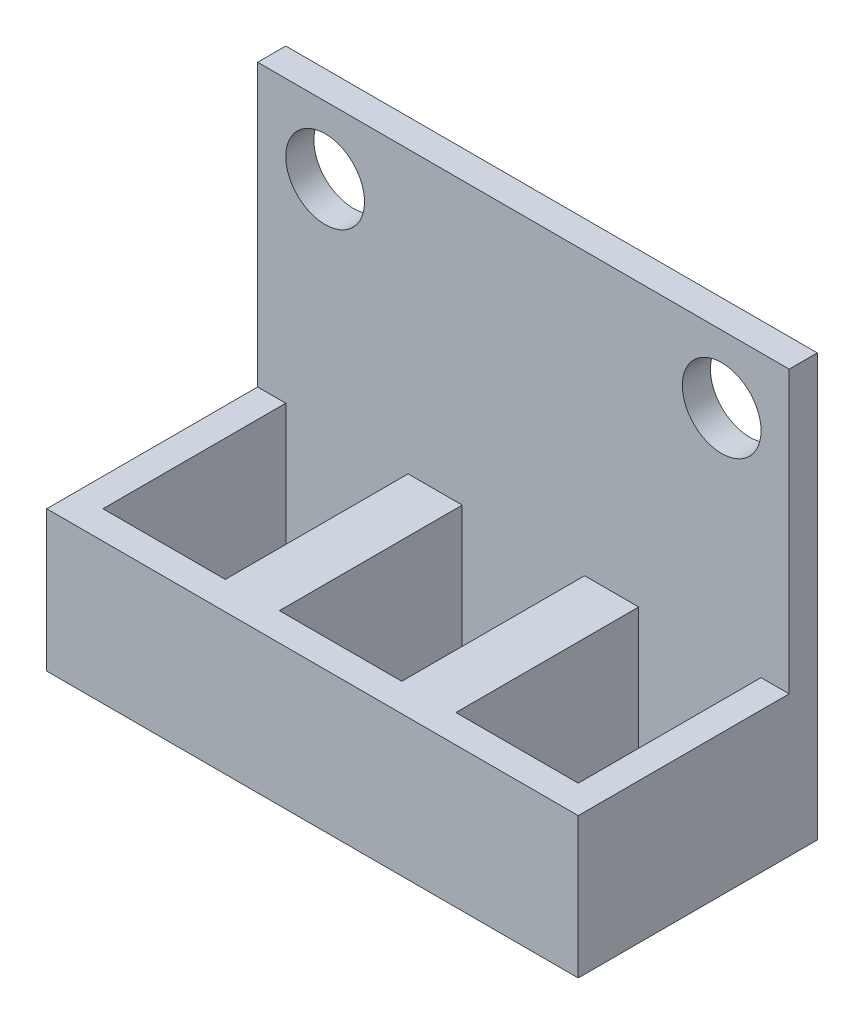
ISO-10303-21;
HEADER;
FILE_DESCRIPTION(('STEP AP214'),'2;1');
FILE_NAME('part.step','',(''),(''),'','','');
FILE_SCHEMA(('AUTOMOTIVE_DESIGN { 1 0 10303 214 1 1 1 1 }'));
ENDSEC;
DATA;
#1=APPLICATION_CONTEXT('core data for automotive mechanical design processes');
#2=APPLICATION_PROTOCOL_DEFINITION('international standard','automotive_design',2000,#1);
#3=PRODUCT_CONTEXT('',#1,'mechanical');
#4=PRODUCT('Part','Part','',(#3));
#5=PRODUCT_RELATED_PRODUCT_CATEGORY('part','',(#4));
#6=PRODUCT_DEFINITION_FORMATION('','',#4);
#7=PRODUCT_DEFINITION_CONTEXT('part definition',#1,'design');
#8=PRODUCT_DEFINITION('design','',#6,#7);
#9=PRODUCT_DEFINITION_SHAPE('','',#8);
#10=(LENGTH_UNIT() NAMED_UNIT(*) SI_UNIT(.MILLI.,.METRE.));
#11=(NAMED_UNIT(*) PLANE_ANGLE_UNIT() SI_UNIT($,.RADIAN.));
#12=(NAMED_UNIT(*) SI_UNIT($,.STERADIAN.) SOLID_ANGLE_UNIT());
#13=UNCERTAINTY_MEASURE_WITH_UNIT(LENGTH_MEASURE(1.E-05),#10,'distance_accuracy_value','');
#14=(GEOMETRIC_REPRESENTATION_CONTEXT(3) GLOBAL_UNCERTAINTY_ASSIGNED_CONTEXT((#13)) GLOBAL_UNIT_ASSIGNED_CONTEXT((#10,
#11,#12)) REPRESENTATION_CONTEXT('',''));
#15=CARTESIAN_POINT('',(0.,0.,0.));
#16=DIRECTION('',(0.,0.,1.));
#17=DIRECTION('',(1.,0.,0.));
#18=AXIS2_PLACEMENT_3D('',#15,#16,#17);
#19=CARTESIAN_POINT('',(0.,5.,0.));
#20=DIRECTION('',(0.,-1.,0.));
#21=DIRECTION('',(0.,0.,-1.));
#22=AXIS2_PLACEMENT_3D('',#19,#20,#21);
#23=PLANE('',#22);
#24=DIRECTION('',(1.,0.,0.));
#25=VECTOR('',#24,1.);
#26=CARTESIAN_POINT('',(-9.45,5.,-3.24999999999999));
#27=LINE('',#26,#25);
#28=CARTESIAN_POINT('',(-9.45,5.,-3.24999999999999));
#29=VERTEX_POINT('',#28);
#30=CARTESIAN_POINT('',(-8.45,5.,-3.25));
#31=VERTEX_POINT('',#30);
#32=EDGE_CURVE('E52',#29,#31,#27,.T.);
#33=ORIENTED_EDGE('',*,*,#32,.F.);
#34=DIRECTION('',(0.,0.,1.));
#35=VECTOR('',#34,1.);
#36=CARTESIAN_POINT('',(-9.45,5.,4.25000000000001));
#37=LINE('',#36,#35);
#38=CARTESIAN_POINT('',(-9.45,5.,4.25000000000001));
#39=VERTEX_POINT('',#38);
#40=EDGE_CURVE('E187',#29,#39,#37,.T.);
#41=ORIENTED_EDGE('',*,*,#40,.T.);
#42=DIRECTION('',(1.,0.,0.));
#43=VECTOR('',#42,1.);
#44=CARTESIAN_POINT('',(-9.45,5.,4.25000000000001));
#45=LINE('',#44,#43);
#46=CARTESIAN_POINT('',(9.45,5.,4.25000000000001));
#47=VERTEX_POINT('',#46);
#48=EDGE_CURVE('E298',#39,#47,#45,.T.);
#49=ORIENTED_EDGE('',*,*,#48,.T.);
#50=DIRECTION('',(0.,0.,-1.));
#51=VECTOR('',#50,1.);
#52=CARTESIAN_POINT('',(9.45,5.,4.25000000000001));
#53=LINE('',#52,#51);
#54=CARTESIAN_POINT('',(9.45,5.,-3.24999999999999));
#55=VERTEX_POINT('',#54);
#56=EDGE_CURVE('E293',#47,#55,#53,.T.);
#57=ORIENTED_EDGE('',*,*,#56,.T.);
#58=CARTESIAN_POINT('',(8.45,5.,-3.24999999999999));
#59=VERTEX_POINT('',#58);
#60=EDGE_CURVE('E235',#59,#55,#27,.T.);
#61=ORIENTED_EDGE('',*,*,#60,.F.);
#62=DIRECTION('',(0.,0.,-1.));
#63=VECTOR('',#62,1.);
#64=CARTESIAN_POINT('',(8.45,5.,-3.24999999999999));
#65=LINE('',#64,#63);
#66=CARTESIAN_POINT('',(8.45,5.,3.25));
#67=VERTEX_POINT('',#66);
#68=EDGE_CURVE('E258',#67,#59,#65,.T.);
#69=ORIENTED_EDGE('',*,*,#68,.F.);
#70=DIRECTION('',(1.,0.,0.));
#71=VECTOR('',#70,1.);
#72=CARTESIAN_POINT('',(4.1,5.,3.25));
#73=LINE('',#72,#71);
#74=CARTESIAN_POINT('',(4.1,5.,3.25));
#75=VERTEX_POINT('',#74);
#76=EDGE_CURVE('E257',#75,#67,#73,.T.);
#77=ORIENTED_EDGE('',*,*,#76,.F.);
#78=DIRECTION('',(0.,0.,1.));
#79=VECTOR('',#78,1.);
#80=CARTESIAN_POINT('',(4.1,5.,-3.24999999999999));
#81=LINE('',#80,#79);
#82=CARTESIAN_POINT('',(4.1,5.,-3.24999999999999));
#83=VERTEX_POINT('',#82);
#84=EDGE_CURVE('E255',#83,#75,#81,.T.);
#85=ORIENTED_EDGE('',*,*,#84,.F.);
#86=CARTESIAN_POINT('',(2.175,5.,-3.24999999999999));
#87=VERTEX_POINT('',#86);
#88=EDGE_CURVE('E44',#87,#83,#27,.T.);
#89=ORIENTED_EDGE('',*,*,#88,.F.);
#90=DIRECTION('',(0.,0.,-1.));
#91=VECTOR('',#90,1.);
#92=CARTESIAN_POINT('',(2.175,5.,-3.24999999999999));
#93=LINE('',#92,#91);
#94=CARTESIAN_POINT('',(2.175,5.,3.25));
#95=VERTEX_POINT('',#94);
#96=EDGE_CURVE('E223',#95,#87,#93,.T.);
#97=ORIENTED_EDGE('',*,*,#96,.F.);
#98=DIRECTION('',(1.,0.,0.));
#99=VECTOR('',#98,1.);
#100=CARTESIAN_POINT('',(-2.175,5.,3.25));
#101=LINE('',#100,#99);
#102=CARTESIAN_POINT('',(-2.175,5.,3.25));
#103=VERTEX_POINT('',#102);
#104=EDGE_CURVE('E222',#103,#95,#101,.T.);
#105=ORIENTED_EDGE('',*,*,#104,.F.);
#106=DIRECTION('',(0.,0.,1.));
#107=VECTOR('',#106,1.);
#108=CARTESIAN_POINT('',(-2.175,5.,-3.24999999999999));
#109=LINE('',#108,#107);
#110=CARTESIAN_POINT('',(-2.175,5.,-3.24999999999999));
#111=VERTEX_POINT('',#110);
#112=EDGE_CURVE('E219',#111,#103,#109,.T.);
#113=ORIENTED_EDGE('',*,*,#112,.F.);
#114=CARTESIAN_POINT('',(-4.1,5.,-3.25));
#115=VERTEX_POINT('',#114);
#116=EDGE_CURVE('E11',#115,#111,#27,.T.);
#117=ORIENTED_EDGE('',*,*,#116,.F.);
#118=DIRECTION('',(0.,0.,-1.));
#119=VECTOR('',#118,1.);
#120=CARTESIAN_POINT('',(-4.1,5.,-3.25));
#121=LINE('',#120,#119);
#122=CARTESIAN_POINT('',(-4.1,5.,3.25));
#123=VERTEX_POINT('',#122);
#124=EDGE_CURVE('E200',#123,#115,#121,.T.);
#125=ORIENTED_EDGE('',*,*,#124,.F.);
#126=DIRECTION('',(1.,0.,0.));
#127=VECTOR('',#126,1.);
#128=CARTESIAN_POINT('',(-8.45,5.,3.25));
#129=LINE('',#128,#127);
#130=CARTESIAN_POINT('',(-8.45,5.,3.25));
#131=VERTEX_POINT('',#130);
#132=EDGE_CURVE('E199',#131,#123,#129,.T.);
#133=ORIENTED_EDGE('',*,*,#132,.F.);
#134=DIRECTION('',(0.,0.,1.));
#135=VECTOR('',#134,1.);
#136=CARTESIAN_POINT('',(-8.45,5.,-3.25));
#137=LINE('',#136,#135);
#138=EDGE_CURVE('E196',#31,#131,#137,.T.);
#139=ORIENTED_EDGE('',*,*,#138,.F.);
#140=EDGE_LOOP('',(#33,#41,#49,#57,#61,#69,#77,#85,#89,#97,#105,#113,#117,#125,#133,#139));
#141=FACE_BOUND('',#140,.T.);
#142=ADVANCED_FACE('F35',(#141),#23,.F.);
#143=CARTESIAN_POINT('',(0.,0.,0.));
#144=DIRECTION('',(0.,-1.,0.));
#145=DIRECTION('',(0.,0.,-1.));
#146=AXIS2_PLACEMENT_3D('',#143,#144,#145);
#147=PLANE('',#146);
#148=DIRECTION('',(1.,0.,0.));
#149=VECTOR('',#148,1.);
#150=CARTESIAN_POINT('',(-2.175,0.,3.25));
#151=LINE('',#150,#149);
#152=CARTESIAN_POINT('',(-2.175,0.,3.25));
#153=VERTEX_POINT('',#152);
#154=CARTESIAN_POINT('',(2.175,0.,3.25));
#155=VERTEX_POINT('',#154);
#156=EDGE_CURVE('E263',#153,#155,#151,.T.);
#157=ORIENTED_EDGE('',*,*,#156,.T.);
#158=DIRECTION('',(0.,0.,-1.));
#159=VECTOR('',#158,1.);
#160=CARTESIAN_POINT('',(2.175,0.,-3.24999999999999));
#161=LINE('',#160,#159);
#162=CARTESIAN_POINT('',(2.175,0.,-3.24999999999999));
#163=VERTEX_POINT('',#162);
#164=EDGE_CURVE('E558',#155,#163,#161,.T.);
#165=ORIENTED_EDGE('',*,*,#164,.T.);
#166=DIRECTION('',(-1.,0.,0.));
#167=VECTOR('',#166,1.);
#168=CARTESIAN_POINT('',(-2.175,0.,-3.24999999999999));
#169=LINE('',#168,#167);
#170=CARTESIAN_POINT('',(-2.175,0.,-3.24999999999999));
#171=VERTEX_POINT('',#170);
#172=EDGE_CURVE('E560',#163,#171,#169,.T.);
#173=ORIENTED_EDGE('',*,*,#172,.T.);
#174=DIRECTION('',(0.,0.,1.));
#175=VECTOR('',#174,1.);
#176=CARTESIAN_POINT('',(-2.175,0.,-3.24999999999999));
#177=LINE('',#176,#175);
#178=EDGE_CURVE('E563',#171,#153,#177,.T.);
#179=ORIENTED_EDGE('',*,*,#178,.T.);
#180=EDGE_LOOP('',(#157,#165,#173,#179));
#181=FACE_BOUND('',#180,.T.);
#182=DIRECTION('',(0.,0.,-1.));
#183=VECTOR('',#182,1.);
#184=CARTESIAN_POINT('',(9.45,0.,4.25000000000001));
#185=LINE('',#184,#183);
#186=CARTESIAN_POINT('',(9.45,0.,4.25000000000001));
#187=VERTEX_POINT('',#186);
#188=CARTESIAN_POINT('',(9.45,0.,-4.25));
#189=VERTEX_POINT('',#188);
#190=EDGE_CURVE('E211',#187,#189,#185,.T.);
#191=ORIENTED_EDGE('',*,*,#190,.F.);
#192=DIRECTION('',(1.,0.,0.));
#193=VECTOR('',#192,1.);
#194=CARTESIAN_POINT('',(-9.45,0.,4.25000000000001));
#195=LINE('',#194,#193);
#196=CARTESIAN_POINT('',(-9.45,0.,4.25000000000001));
#197=VERTEX_POINT('',#196);
#198=EDGE_CURVE('E295',#197,#187,#195,.T.);
#199=ORIENTED_EDGE('',*,*,#198,.F.);
#200=DIRECTION('',(0.,0.,1.));
#201=VECTOR('',#200,1.);
#202=CARTESIAN_POINT('',(-9.45,0.,4.25000000000001));
#203=LINE('',#202,#201);
#204=CARTESIAN_POINT('',(-9.45,0.,-4.25));
#205=VERTEX_POINT('',#204);
#206=EDGE_CURVE('E310',#205,#197,#203,.T.);
#207=ORIENTED_EDGE('',*,*,#206,.F.);
#208=DIRECTION('',(-1.,0.,0.));
#209=VECTOR('',#208,1.);
#210=CARTESIAN_POINT('',(-9.45,0.,-4.25));
#211=LINE('',#210,#209);
#212=EDGE_CURVE('E308',#189,#205,#211,.T.);
#213=ORIENTED_EDGE('',*,*,#212,.F.);
#214=EDGE_LOOP('',(#191,#199,#207,#213));
#215=FACE_BOUND('',#214,.T.);
#216=DIRECTION('',(1.,0.,0.));
#217=VECTOR('',#216,1.);
#218=CARTESIAN_POINT('',(-8.45,0.,3.25));
#219=LINE('',#218,#217);
#220=CARTESIAN_POINT('',(-8.45,0.,3.25));
#221=VERTEX_POINT('',#220);
#222=CARTESIAN_POINT('',(-4.1,0.,3.25));
#223=VERTEX_POINT('',#222);
#224=EDGE_CURVE('E216',#221,#223,#219,.T.);
#225=ORIENTED_EDGE('',*,*,#224,.T.);
#226=DIRECTION('',(0.,0.,-1.));
#227=VECTOR('',#226,1.);
#228=CARTESIAN_POINT('',(-4.1,0.,-3.25));
#229=LINE('',#228,#227);
#230=CARTESIAN_POINT('',(-4.1,0.,-3.25));
#231=VERTEX_POINT('',#230);
#232=EDGE_CURVE('E266',#223,#231,#229,.T.);
#233=ORIENTED_EDGE('',*,*,#232,.T.);
#234=DIRECTION('',(-1.,0.,0.));
#235=VECTOR('',#234,1.);
#236=CARTESIAN_POINT('',(-8.45,0.,-3.25));
#237=LINE('',#236,#235);
#238=CARTESIAN_POINT('',(-8.45,0.,-3.25));
#239=VERTEX_POINT('',#238);
#240=EDGE_CURVE('E271',#231,#239,#237,.T.);
#241=ORIENTED_EDGE('',*,*,#240,.T.);
#242=DIRECTION('',(0.,0.,1.));
#243=VECTOR('',#242,1.);
#244=CARTESIAN_POINT('',(-8.45,0.,-3.25));
#245=LINE('',#244,#243);
#246=EDGE_CURVE('E276',#239,#221,#245,.T.);
#247=ORIENTED_EDGE('',*,*,#246,.T.);
#248=EDGE_LOOP('',(#225,#233,#241,#247));
#249=FACE_BOUND('',#248,.T.);
#250=DIRECTION('',(1.,0.,0.));
#251=VECTOR('',#250,1.);
#252=CARTESIAN_POINT('',(4.1,0.,3.25));
#253=LINE('',#252,#251);
#254=CARTESIAN_POINT('',(4.1,0.,3.25));
#255=VERTEX_POINT('',#254);
#256=CARTESIAN_POINT('',(8.45,0.,3.25));
#257=VERTEX_POINT('',#256);
#258=EDGE_CURVE('E547',#255,#257,#253,.T.);
#259=ORIENTED_EDGE('',*,*,#258,.T.);
#260=DIRECTION('',(0.,0.,-1.));
#261=VECTOR('',#260,1.);
#262=CARTESIAN_POINT('',(8.45,0.,-3.24999999999999));
#263=LINE('',#262,#261);
#264=CARTESIAN_POINT('',(8.45,0.,-3.24999999999999));
#265=VERTEX_POINT('',#264);
#266=EDGE_CURVE('E188',#257,#265,#263,.T.);
#267=ORIENTED_EDGE('',*,*,#266,.T.);
#268=DIRECTION('',(-1.,0.,0.));
#269=VECTOR('',#268,1.);
#270=CARTESIAN_POINT('',(4.1,0.,-3.24999999999999));
#271=LINE('',#270,#269);
#272=CARTESIAN_POINT('',(4.1,0.,-3.24999999999999));
#273=VERTEX_POINT('',#272);
#274=EDGE_CURVE('E190',#265,#273,#271,.T.);
#275=ORIENTED_EDGE('',*,*,#274,.T.);
#276=DIRECTION('',(0.,0.,1.));
#277=VECTOR('',#276,1.);
#278=CARTESIAN_POINT('',(4.1,0.,-3.24999999999999));
#279=LINE('',#278,#277);
#280=EDGE_CURVE('E542',#273,#255,#279,.T.);
#281=ORIENTED_EDGE('',*,*,#280,.T.);
#282=EDGE_LOOP('',(#259,#267,#275,#281));
#283=FACE_BOUND('',#282,.T.);
#284=ADVANCED_FACE('F366',(#181,#215,#249,#283),#147,.T.);
#285=CARTESIAN_POINT('',(9.45,5.,4.25000000000001));
#286=DIRECTION('',(-1.,0.,0.));
#287=DIRECTION('',(0.,0.,1.));
#288=AXIS2_PLACEMENT_3D('',#285,#286,#287);
#289=PLANE('',#288);
#290=ORIENTED_EDGE('',*,*,#190,.T.);
#291=DIRECTION('',(0.,-1.,0.));
#292=VECTOR('',#291,1.);
#293=CARTESIAN_POINT('',(9.45,5.,-4.25));
#294=LINE('',#293,#292);
#295=CARTESIAN_POINT('',(9.45,15.,-4.25));
#296=VERTEX_POINT('',#295);
#297=EDGE_CURVE('E296',#296,#189,#294,.T.);
#298=ORIENTED_EDGE('',*,*,#297,.F.);
#299=DIRECTION('',(0.,0.,-1.));
#300=VECTOR('',#299,1.);
#301=CARTESIAN_POINT('',(9.45,15.,-4.25));
#302=LINE('',#301,#300);
#303=CARTESIAN_POINT('',(9.45,15.,-3.24999999999999));
#304=VERTEX_POINT('',#303);
#305=EDGE_CURVE('E174',#304,#296,#302,.T.);
#306=ORIENTED_EDGE('',*,*,#305,.F.);
#307=DIRECTION('',(0.,-1.,0.));
#308=VECTOR('',#307,1.);
#309=CARTESIAN_POINT('',(9.45,15.,-3.24999999999999));
#310=LINE('',#309,#308);
#311=EDGE_CURVE('E170',#304,#55,#310,.T.);
#312=ORIENTED_EDGE('',*,*,#311,.T.);
#313=ORIENTED_EDGE('',*,*,#56,.F.);
#314=DIRECTION('',(0.,-1.,0.));
#315=VECTOR('',#314,1.);
#316=CARTESIAN_POINT('',(9.45,5.,4.25000000000001));
#317=LINE('',#316,#315);
#318=EDGE_CURVE('E299',#47,#187,#317,.T.);
#319=ORIENTED_EDGE('',*,*,#318,.T.);
#320=EDGE_LOOP('',(#290,#298,#306,#312,#313,#319));
#321=FACE_BOUND('',#320,.T.);
#322=ADVANCED_FACE('F37',(#321),#289,.F.);
#323=CARTESIAN_POINT('',(-9.45,5.,-4.25));
#324=DIRECTION('',(0.,0.,1.));
#325=DIRECTION('',(1.,0.,0.));
#326=AXIS2_PLACEMENT_3D('',#323,#324,#325);
#327=PLANE('',#326);
#328=CARTESIAN_POINT('',(-7.05,12.6,-4.25));
#329=DIRECTION('',(0.,0.,1.));
#330=DIRECTION('',(1.,0.,0.));
#331=AXIS2_PLACEMENT_3D('',#328,#329,#330);
#332=CIRCLE('',#331,1.4);
#333=CARTESIAN_POINT('',(-5.65,12.6,-4.25));
#334=VERTEX_POINT('',#333);
#335=EDGE_CURVE('E330',#334,#334,#332,.T.);
#336=ORIENTED_EDGE('',*,*,#335,.T.);
#337=EDGE_LOOP('',(#336));
#338=FACE_BOUND('',#337,.T.);
#339=CARTESIAN_POINT('',(7.05,12.6,-4.25));
#340=DIRECTION('',(0.,0.,1.));
#341=DIRECTION('',(1.,0.,0.));
#342=AXIS2_PLACEMENT_3D('',#339,#340,#341);
#343=CIRCLE('',#342,1.4);
#344=CARTESIAN_POINT('',(8.45,12.6,-4.25));
#345=VERTEX_POINT('',#344);
#346=EDGE_CURVE('E329',#345,#345,#343,.T.);
#347=ORIENTED_EDGE('',*,*,#346,.T.);
#348=EDGE_LOOP('',(#347));
#349=FACE_BOUND('',#348,.T.);
#350=ORIENTED_EDGE('',*,*,#212,.T.);
#351=DIRECTION('',(0.,-1.,0.));
#352=VECTOR('',#351,1.);
#353=CARTESIAN_POINT('',(-9.45,5.,-4.25));
#354=LINE('',#353,#352);
#355=CARTESIAN_POINT('',(-9.45,15.,-4.25));
#356=VERTEX_POINT('',#355);
#357=EDGE_CURVE('E314',#356,#205,#354,.T.);
#358=ORIENTED_EDGE('',*,*,#357,.F.);
#359=DIRECTION('',(-1.,0.,0.));
#360=VECTOR('',#359,1.);
#361=CARTESIAN_POINT('',(-9.45,15.,-4.25));
#362=LINE('',#361,#360);
#363=EDGE_CURVE('E181',#296,#356,#362,.T.);
#364=ORIENTED_EDGE('',*,*,#363,.F.);
#365=ORIENTED_EDGE('',*,*,#297,.T.);
#366=EDGE_LOOP('',(#350,#358,#364,#365));
#367=FACE_BOUND('',#366,.T.);
#368=ADVANCED_FACE('F339',(#338,#349,#367),#327,.F.);
#369=CARTESIAN_POINT('',(-9.45,5.,4.25000000000001));
#370=DIRECTION('',(1.,0.,0.));
#371=DIRECTION('',(0.,0.,-1.));
#372=AXIS2_PLACEMENT_3D('',#369,#370,#371);
#373=PLANE('',#372);
#374=ORIENTED_EDGE('',*,*,#206,.T.);
#375=DIRECTION('',(0.,-1.,0.));
#376=VECTOR('',#375,1.);
#377=CARTESIAN_POINT('',(-9.45,5.,4.25000000000001));
#378=LINE('',#377,#376);
#379=EDGE_CURVE('E303',#39,#197,#378,.T.);
#380=ORIENTED_EDGE('',*,*,#379,.F.);
#381=ORIENTED_EDGE('',*,*,#40,.F.);
#382=DIRECTION('',(0.,-1.,0.));
#383=VECTOR('',#382,1.);
#384=CARTESIAN_POINT('',(-9.45,15.,-3.24999999999999));
#385=LINE('',#384,#383);
#386=CARTESIAN_POINT('',(-9.45,15.,-3.24999999999999));
#387=VERTEX_POINT('',#386);
#388=EDGE_CURVE('E167',#387,#29,#385,.T.);
#389=ORIENTED_EDGE('',*,*,#388,.F.);
#390=DIRECTION('',(0.,0.,1.));
#391=VECTOR('',#390,1.);
#392=CARTESIAN_POINT('',(-9.45,15.,-4.25));
#393=LINE('',#392,#391);
#394=EDGE_CURVE('E175',#356,#387,#393,.T.);
#395=ORIENTED_EDGE('',*,*,#394,.F.);
#396=ORIENTED_EDGE('',*,*,#357,.T.);
#397=EDGE_LOOP('',(#374,#380,#381,#389,#395,#396));
#398=FACE_BOUND('',#397,.T.);
#399=ADVANCED_FACE('F185',(#398),#373,.F.);
#400=CARTESIAN_POINT('',(-9.45,5.,4.25000000000001));
#401=DIRECTION('',(0.,0.,-1.));
#402=DIRECTION('',(-1.,0.,0.));
#403=AXIS2_PLACEMENT_3D('',#400,#401,#402);
#404=PLANE('',#403);
#405=ORIENTED_EDGE('',*,*,#198,.T.);
#406=ORIENTED_EDGE('',*,*,#318,.F.);
#407=ORIENTED_EDGE('',*,*,#48,.F.);
#408=ORIENTED_EDGE('',*,*,#379,.T.);
#409=EDGE_LOOP('',(#405,#406,#407,#408));
#410=FACE_BOUND('',#409,.T.);
#411=ADVANCED_FACE('F375',(#410),#404,.F.);
#412=CARTESIAN_POINT('',(-4.1,5.,-3.25));
#413=DIRECTION('',(-1.,0.,0.));
#414=DIRECTION('',(0.,0.,1.));
#415=AXIS2_PLACEMENT_3D('',#412,#413,#414);
#416=PLANE('',#415);
#417=ORIENTED_EDGE('',*,*,#232,.F.);
#418=DIRECTION('',(0.,-1.,0.));
#419=VECTOR('',#418,1.);
#420=CARTESIAN_POINT('',(-4.1,5.,3.25));
#421=LINE('',#420,#419);
#422=EDGE_CURVE('E284',#123,#223,#421,.T.);
#423=ORIENTED_EDGE('',*,*,#422,.F.);
#424=ORIENTED_EDGE('',*,*,#124,.T.);
#425=DIRECTION('',(0.,-1.,0.));
#426=VECTOR('',#425,1.);
#427=CARTESIAN_POINT('',(-4.1,5.,-3.25));
#428=LINE('',#427,#426);
#429=EDGE_CURVE('E205',#115,#231,#428,.T.);
#430=ORIENTED_EDGE('',*,*,#429,.T.);
#431=EDGE_LOOP('',(#417,#423,#424,#430));
#432=FACE_BOUND('',#431,.T.);
#433=ADVANCED_FACE('F352',(#432),#416,.T.);
#434=CARTESIAN_POINT('',(-8.45,5.,-3.25));
#435=DIRECTION('',(0.,0.,1.));
#436=DIRECTION('',(1.,0.,0.));
#437=AXIS2_PLACEMENT_3D('',#434,#435,#436);
#438=PLANE('',#437);
#439=CARTESIAN_POINT('',(-7.05,12.6,-3.25));
#440=DIRECTION('',(0.,0.,1.));
#441=DIRECTION('',(1.,0.,0.));
#442=AXIS2_PLACEMENT_3D('',#439,#440,#441);
#443=CIRCLE('',#442,1.4);
#444=CARTESIAN_POINT('',(-5.65,12.6,-3.25));
#445=VERTEX_POINT('',#444);
#446=EDGE_CURVE('E333',#445,#445,#443,.T.);
#447=ORIENTED_EDGE('',*,*,#446,.F.);
#448=EDGE_LOOP('',(#447));
#449=FACE_BOUND('',#448,.T.);
#450=CARTESIAN_POINT('',(7.05,12.6,-3.25));
#451=DIRECTION('',(0.,0.,1.));
#452=DIRECTION('',(1.,0.,0.));
#453=AXIS2_PLACEMENT_3D('',#450,#451,#452);
#454=CIRCLE('',#453,1.4);
#455=CARTESIAN_POINT('',(8.45,12.6,-3.25));
#456=VERTEX_POINT('',#455);
#457=EDGE_CURVE('E326',#456,#456,#454,.T.);
#458=ORIENTED_EDGE('',*,*,#457,.F.);
#459=EDGE_LOOP('',(#458));
#460=FACE_BOUND('',#459,.T.);
#461=ORIENTED_EDGE('',*,*,#240,.F.);
#462=ORIENTED_EDGE('',*,*,#429,.F.);
#463=ORIENTED_EDGE('',*,*,#116,.T.);
#464=DIRECTION('',(0.,-1.,0.));
#465=VECTOR('',#464,1.);
#466=CARTESIAN_POINT('',(-2.175,5.,-3.24999999999999));
#467=LINE('',#466,#465);
#468=EDGE_CURVE('E226',#111,#171,#467,.T.);
#469=ORIENTED_EDGE('',*,*,#468,.T.);
#470=ORIENTED_EDGE('',*,*,#172,.F.);
#471=DIRECTION('',(0.,-1.,0.));
#472=VECTOR('',#471,1.);
#473=CARTESIAN_POINT('',(2.175,5.,-3.24999999999999));
#474=LINE('',#473,#472);
#475=EDGE_CURVE('E227',#87,#163,#474,.T.);
#476=ORIENTED_EDGE('',*,*,#475,.F.);
#477=ORIENTED_EDGE('',*,*,#88,.T.);
#478=DIRECTION('',(0.,-1.,0.));
#479=VECTOR('',#478,1.);
#480=CARTESIAN_POINT('',(4.1,5.,-3.24999999999999));
#481=LINE('',#480,#479);
#482=EDGE_CURVE('E250',#83,#273,#481,.T.);
#483=ORIENTED_EDGE('',*,*,#482,.T.);
#484=ORIENTED_EDGE('',*,*,#274,.F.);
#485=DIRECTION('',(0.,-1.,0.));
#486=VECTOR('',#485,1.);
#487=CARTESIAN_POINT('',(8.45,5.,-3.24999999999999));
#488=LINE('',#487,#486);
#489=EDGE_CURVE('E252',#59,#265,#488,.T.);
#490=ORIENTED_EDGE('',*,*,#489,.F.);
#491=ORIENTED_EDGE('',*,*,#60,.T.);
#492=ORIENTED_EDGE('',*,*,#311,.F.);
#493=DIRECTION('',(1.,0.,0.));
#494=VECTOR('',#493,1.);
#495=CARTESIAN_POINT('',(-9.45,15.,-3.24999999999999));
#496=LINE('',#495,#494);
#497=EDGE_CURVE('E163',#387,#304,#496,.T.);
#498=ORIENTED_EDGE('',*,*,#497,.F.);
#499=ORIENTED_EDGE('',*,*,#388,.T.);
#500=ORIENTED_EDGE('',*,*,#32,.T.);
#501=DIRECTION('',(0.,-1.,0.));
#502=VECTOR('',#501,1.);
#503=CARTESIAN_POINT('',(-8.45,5.,-3.25));
#504=LINE('',#503,#502);
#505=EDGE_CURVE('E203',#31,#239,#504,.T.);
#506=ORIENTED_EDGE('',*,*,#505,.T.);
#507=EDGE_LOOP('',(#461,#462,#463,#469,#470,#476,#477,#483,#484,#490,#491,#492,#498,#499,#500,#506));
#508=FACE_BOUND('',#507,.T.);
#509=ADVANCED_FACE('F165',(#449,#460,#508),#438,.T.);
#510=CARTESIAN_POINT('',(-8.45,5.,-3.25));
#511=DIRECTION('',(1.,0.,0.));
#512=DIRECTION('',(0.,0.,-1.));
#513=AXIS2_PLACEMENT_3D('',#510,#511,#512);
#514=PLANE('',#513);
#515=ORIENTED_EDGE('',*,*,#246,.F.);
#516=ORIENTED_EDGE('',*,*,#505,.F.);
#517=ORIENTED_EDGE('',*,*,#138,.T.);
#518=DIRECTION('',(0.,-1.,0.));
#519=VECTOR('',#518,1.);
#520=CARTESIAN_POINT('',(-8.45,5.,3.25));
#521=LINE('',#520,#519);
#522=EDGE_CURVE('E206',#131,#221,#521,.T.);
#523=ORIENTED_EDGE('',*,*,#522,.T.);
#524=EDGE_LOOP('',(#515,#516,#517,#523));
#525=FACE_BOUND('',#524,.T.);
#526=ADVANCED_FACE('F351',(#525),#514,.T.);
#527=CARTESIAN_POINT('',(-8.45,5.,3.25));
#528=DIRECTION('',(0.,0.,-1.));
#529=DIRECTION('',(-1.,0.,0.));
#530=AXIS2_PLACEMENT_3D('',#527,#528,#529);
#531=PLANE('',#530);
#532=ORIENTED_EDGE('',*,*,#224,.F.);
#533=ORIENTED_EDGE('',*,*,#522,.F.);
#534=ORIENTED_EDGE('',*,*,#132,.T.);
#535=ORIENTED_EDGE('',*,*,#422,.T.);
#536=EDGE_LOOP('',(#532,#533,#534,#535));
#537=FACE_BOUND('',#536,.T.);
#538=ADVANCED_FACE('F406',(#537),#531,.T.);
#539=CARTESIAN_POINT('',(2.175,5.,-3.24999999999999));
#540=DIRECTION('',(-1.,0.,0.));
#541=DIRECTION('',(0.,0.,1.));
#542=AXIS2_PLACEMENT_3D('',#539,#540,#541);
#543=PLANE('',#542);
#544=ORIENTED_EDGE('',*,*,#164,.F.);
#545=DIRECTION('',(0.,-1.,0.));
#546=VECTOR('',#545,1.);
#547=CARTESIAN_POINT('',(2.175,5.,3.25));
#548=LINE('',#547,#546);
#549=EDGE_CURVE('E557',#95,#155,#548,.T.);
#550=ORIENTED_EDGE('',*,*,#549,.F.);
#551=ORIENTED_EDGE('',*,*,#96,.T.);
#552=ORIENTED_EDGE('',*,*,#475,.T.);
#553=EDGE_LOOP('',(#544,#550,#551,#552));
#554=FACE_BOUND('',#553,.T.);
#555=ADVANCED_FACE('F411',(#554),#543,.T.);
#556=CARTESIAN_POINT('',(-2.175,5.,-3.24999999999999));
#557=DIRECTION('',(1.,0.,0.));
#558=DIRECTION('',(0.,0.,-1.));
#559=AXIS2_PLACEMENT_3D('',#556,#557,#558);
#560=PLANE('',#559);
#561=ORIENTED_EDGE('',*,*,#178,.F.);
#562=ORIENTED_EDGE('',*,*,#468,.F.);
#563=ORIENTED_EDGE('',*,*,#112,.T.);
#564=DIRECTION('',(0.,-1.,0.));
#565=VECTOR('',#564,1.);
#566=CARTESIAN_POINT('',(-2.175,5.,3.25));
#567=LINE('',#566,#565);
#568=EDGE_CURVE('E228',#103,#153,#567,.T.);
#569=ORIENTED_EDGE('',*,*,#568,.T.);
#570=EDGE_LOOP('',(#561,#562,#563,#569));
#571=FACE_BOUND('',#570,.T.);
#572=ADVANCED_FACE('F427',(#571),#560,.T.);
#573=CARTESIAN_POINT('',(-2.175,5.,3.25));
#574=DIRECTION('',(0.,0.,-1.));
#575=DIRECTION('',(-1.,0.,0.));
#576=AXIS2_PLACEMENT_3D('',#573,#574,#575);
#577=PLANE('',#576);
#578=ORIENTED_EDGE('',*,*,#156,.F.);
#579=ORIENTED_EDGE('',*,*,#568,.F.);
#580=ORIENTED_EDGE('',*,*,#104,.T.);
#581=ORIENTED_EDGE('',*,*,#549,.T.);
#582=EDGE_LOOP('',(#578,#579,#580,#581));
#583=FACE_BOUND('',#582,.T.);
#584=ADVANCED_FACE('F421',(#583),#577,.T.);
#585=CARTESIAN_POINT('',(8.45,5.,-3.24999999999999));
#586=DIRECTION('',(-1.,0.,0.));
#587=DIRECTION('',(0.,0.,1.));
#588=AXIS2_PLACEMENT_3D('',#585,#586,#587);
#589=PLANE('',#588);
#590=ORIENTED_EDGE('',*,*,#266,.F.);
#591=DIRECTION('',(0.,-1.,0.));
#592=VECTOR('',#591,1.);
#593=CARTESIAN_POINT('',(8.45,5.,3.25));
#594=LINE('',#593,#592);
#595=EDGE_CURVE('E552',#67,#257,#594,.T.);
#596=ORIENTED_EDGE('',*,*,#595,.F.);
#597=ORIENTED_EDGE('',*,*,#68,.T.);
#598=ORIENTED_EDGE('',*,*,#489,.T.);
#599=EDGE_LOOP('',(#590,#596,#597,#598));
#600=FACE_BOUND('',#599,.T.);
#601=ADVANCED_FACE('F426',(#600),#589,.T.);
#602=CARTESIAN_POINT('',(4.1,5.,-3.24999999999999));
#603=DIRECTION('',(1.,0.,0.));
#604=DIRECTION('',(0.,0.,-1.));
#605=AXIS2_PLACEMENT_3D('',#602,#603,#604);
#606=PLANE('',#605);
#607=ORIENTED_EDGE('',*,*,#280,.F.);
#608=ORIENTED_EDGE('',*,*,#482,.F.);
#609=ORIENTED_EDGE('',*,*,#84,.T.);
#610=DIRECTION('',(0.,-1.,0.));
#611=VECTOR('',#610,1.);
#612=CARTESIAN_POINT('',(4.1,5.,3.25));
#613=LINE('',#612,#611);
#614=EDGE_CURVE('E60',#75,#255,#613,.T.);
#615=ORIENTED_EDGE('',*,*,#614,.T.);
#616=EDGE_LOOP('',(#607,#608,#609,#615));
#617=FACE_BOUND('',#616,.T.);
#618=ADVANCED_FACE('F440',(#617),#606,.T.);
#619=CARTESIAN_POINT('',(4.1,5.,3.25));
#620=DIRECTION('',(0.,0.,-1.));
#621=DIRECTION('',(-1.,0.,0.));
#622=AXIS2_PLACEMENT_3D('',#619,#620,#621);
#623=PLANE('',#622);
#624=ORIENTED_EDGE('',*,*,#258,.F.);
#625=ORIENTED_EDGE('',*,*,#614,.F.);
#626=ORIENTED_EDGE('',*,*,#76,.T.);
#627=ORIENTED_EDGE('',*,*,#595,.T.);
#628=EDGE_LOOP('',(#624,#625,#626,#627));
#629=FACE_BOUND('',#628,.T.);
#630=ADVANCED_FACE('F362',(#629),#623,.T.);
#631=CARTESIAN_POINT('',(0.,15.,0.));
#632=DIRECTION('',(0.,1.,0.));
#633=DIRECTION('',(0.,0.,1.));
#634=AXIS2_PLACEMENT_3D('',#631,#632,#633);
#635=PLANE('',#634);
#636=ORIENTED_EDGE('',*,*,#394,.T.);
#637=ORIENTED_EDGE('',*,*,#497,.T.);
#638=ORIENTED_EDGE('',*,*,#305,.T.);
#639=ORIENTED_EDGE('',*,*,#363,.T.);
#640=EDGE_LOOP('',(#636,#637,#638,#639));
#641=FACE_BOUND('',#640,.T.);
#642=ADVANCED_FACE('F179',(#641),#635,.T.);
#643=CARTESIAN_POINT('',(7.05,12.6,-4.25));
#644=DIRECTION('',(0.,0.,1.));
#645=DIRECTION('',(1.,0.,0.));
#646=AXIS2_PLACEMENT_3D('',#643,#644,#645);
#647=CYLINDRICAL_SURFACE('',#646,1.4);
#648=ORIENTED_EDGE('',*,*,#346,.F.);
#649=EDGE_LOOP('',(#648));
#650=FACE_BOUND('',#649,.T.);
#651=ORIENTED_EDGE('',*,*,#457,.T.);
#652=EDGE_LOOP('',(#651));
#653=FACE_BOUND('',#652,.T.);
#654=ADVANCED_FACE('F345',(#650,#653),#647,.F.);
#655=CARTESIAN_POINT('',(-7.05,12.6,-4.25));
#656=DIRECTION('',(0.,0.,1.));
#657=DIRECTION('',(1.,0.,0.));
#658=AXIS2_PLACEMENT_3D('',#655,#656,#657);
#659=CYLINDRICAL_SURFACE('',#658,1.4);
#660=ORIENTED_EDGE('',*,*,#335,.F.);
#661=EDGE_LOOP('',(#660));
#662=FACE_BOUND('',#661,.T.);
#663=ORIENTED_EDGE('',*,*,#446,.T.);
#664=EDGE_LOOP('',(#663));
#665=FACE_BOUND('',#664,.T.);
#666=ADVANCED_FACE('F342',(#662,#665),#659,.F.);
#667=CLOSED_SHELL('',(#142,#284,#322,#368,#399,#411,#433,#509,#526,#538,#555,#572,#584,#601,
#618,#630,#642,#654,#666));
#668=MANIFOLD_SOLID_BREP('B2',#667);
#669=ADVANCED_BREP_SHAPE_REPRESENTATION('',(#18,#668),#14);
#670=SHAPE_DEFINITION_REPRESENTATION(#9,#669);
ENDSEC;
END-ISO-10303-21;
